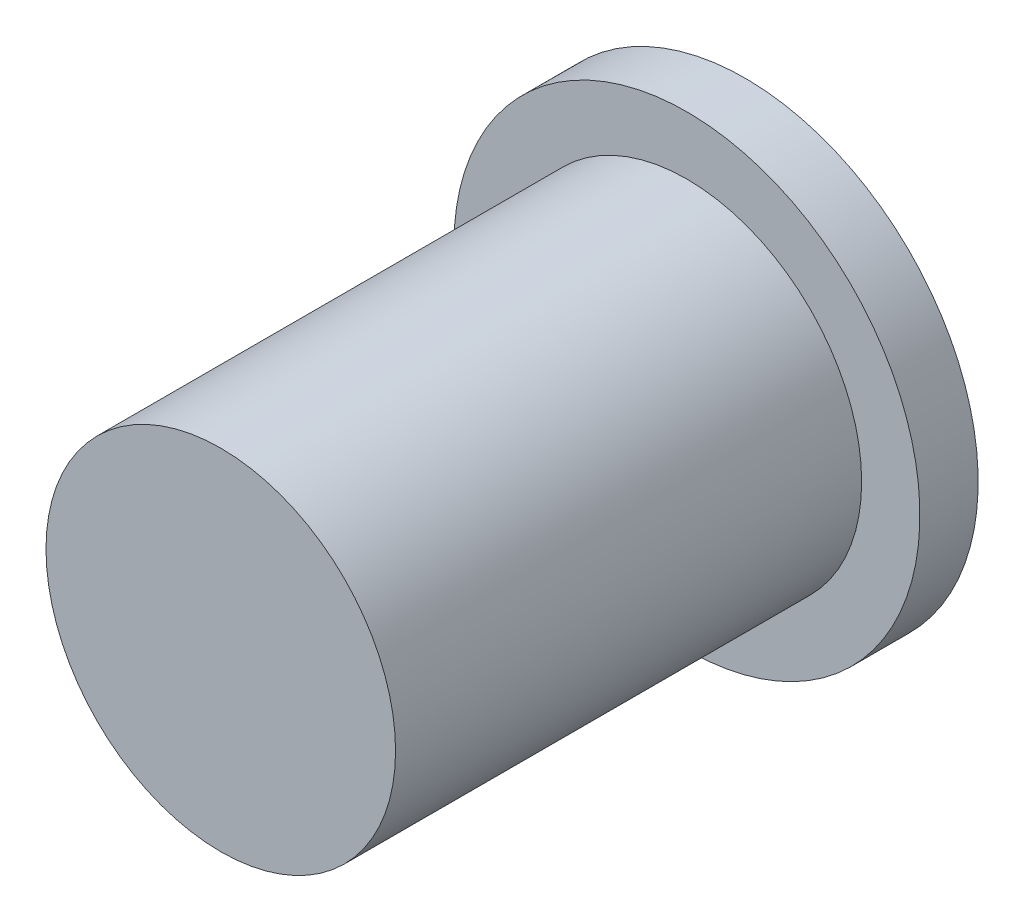
ISO-10303-21;
HEADER;
FILE_DESCRIPTION(('STEP AP214'),'2;1');
FILE_NAME('part.step','',(''),(''),'','','');
FILE_SCHEMA(('AUTOMOTIVE_DESIGN { 1 0 10303 214 1 1 1 1 }'));
ENDSEC;
DATA;
#1=APPLICATION_CONTEXT('core data for automotive mechanical design processes');
#2=APPLICATION_PROTOCOL_DEFINITION('international standard','automotive_design',2000,#1);
#3=PRODUCT_CONTEXT('',#1,'mechanical');
#4=PRODUCT('Part','Part','',(#3));
#5=PRODUCT_RELATED_PRODUCT_CATEGORY('part','',(#4));
#6=PRODUCT_DEFINITION_FORMATION('','',#4);
#7=PRODUCT_DEFINITION_CONTEXT('part definition',#1,'design');
#8=PRODUCT_DEFINITION('design','',#6,#7);
#9=PRODUCT_DEFINITION_SHAPE('','',#8);
#10=(LENGTH_UNIT() NAMED_UNIT(*) SI_UNIT(.MILLI.,.METRE.));
#11=(NAMED_UNIT(*) PLANE_ANGLE_UNIT() SI_UNIT($,.RADIAN.));
#12=(NAMED_UNIT(*) SI_UNIT($,.STERADIAN.) SOLID_ANGLE_UNIT());
#13=UNCERTAINTY_MEASURE_WITH_UNIT(LENGTH_MEASURE(1.E-05),#10,'distance_accuracy_value','');
#14=(GEOMETRIC_REPRESENTATION_CONTEXT(3) GLOBAL_UNCERTAINTY_ASSIGNED_CONTEXT((#13)) GLOBAL_UNIT_ASSIGNED_CONTEXT((#10,
#11,#12)) REPRESENTATION_CONTEXT('',''));
#15=CARTESIAN_POINT('',(0.,0.,0.));
#16=DIRECTION('',(0.,0.,1.));
#17=DIRECTION('',(1.,0.,0.));
#18=AXIS2_PLACEMENT_3D('',#15,#16,#17);
#19=CARTESIAN_POINT('',(0.,0.,40.));
#20=DIRECTION('',(0.,0.,-1.));
#21=DIRECTION('',(-1.,0.,0.));
#22=AXIS2_PLACEMENT_3D('',#19,#20,#21);
#23=CYLINDRICAL_SURFACE('',#22,15.);
#24=CARTESIAN_POINT('',(0.,0.,40.));
#25=DIRECTION('',(0.,0.,1.));
#26=DIRECTION('',(1.,0.,0.));
#27=AXIS2_PLACEMENT_3D('',#24,#25,#26);
#28=CIRCLE('',#27,15.);
#29=CARTESIAN_POINT('',(15.,0.,40.));
#30=VERTEX_POINT('',#29);
#31=EDGE_CURVE('E10',#30,#30,#28,.T.);
#32=ORIENTED_EDGE('',*,*,#31,.F.);
#33=EDGE_LOOP('',(#32));
#34=FACE_BOUND('',#33,.T.);
#35=CARTESIAN_POINT('',(0.,0.,0.));
#36=DIRECTION('',(0.,0.,-1.));
#37=DIRECTION('',(-1.,0.,0.));
#38=AXIS2_PLACEMENT_3D('',#35,#36,#37);
#39=CIRCLE('',#38,15.);
#40=CARTESIAN_POINT('',(-15.,0.,0.));
#41=VERTEX_POINT('',#40);
#42=EDGE_CURVE('E45',#41,#41,#39,.T.);
#43=ORIENTED_EDGE('',*,*,#42,.F.);
#44=EDGE_LOOP('',(#43));
#45=FACE_BOUND('',#44,.T.);
#46=ADVANCED_FACE('F39',(#34,#45),#23,.T.);
#47=CARTESIAN_POINT('',(0.,0.,40.));
#48=DIRECTION('',(0.,0.,1.));
#49=DIRECTION('',(1.,0.,0.));
#50=AXIS2_PLACEMENT_3D('',#47,#48,#49);
#51=PLANE('',#50);
#52=ORIENTED_EDGE('',*,*,#31,.T.);
#53=EDGE_LOOP('',(#52));
#54=FACE_BOUND('',#53,.T.);
#55=ADVANCED_FACE('F72',(#54),#51,.T.);
#56=CARTESIAN_POINT('',(0.,0.,-5.));
#57=DIRECTION('',(0.,0.,1.));
#58=DIRECTION('',(1.,0.,0.));
#59=AXIS2_PLACEMENT_3D('',#56,#57,#58);
#60=CYLINDRICAL_SURFACE('',#59,20.);
#61=CARTESIAN_POINT('',(0.,0.,-5.));
#62=DIRECTION('',(0.,0.,-1.));
#63=DIRECTION('',(-1.,0.,0.));
#64=AXIS2_PLACEMENT_3D('',#61,#62,#63);
#65=CIRCLE('',#64,20.);
#66=CARTESIAN_POINT('',(-20.,0.,-5.));
#67=VERTEX_POINT('',#66);
#68=EDGE_CURVE('E49',#67,#67,#65,.T.);
#69=ORIENTED_EDGE('',*,*,#68,.F.);
#70=EDGE_LOOP('',(#69));
#71=FACE_BOUND('',#70,.T.);
#72=CARTESIAN_POINT('',(0.,0.,0.));
#73=DIRECTION('',(0.,0.,-1.));
#74=DIRECTION('',(-1.,0.,0.));
#75=AXIS2_PLACEMENT_3D('',#72,#73,#74);
#76=CIRCLE('',#75,20.);
#77=CARTESIAN_POINT('',(-20.,0.,0.));
#78=VERTEX_POINT('',#77);
#79=EDGE_CURVE('E53',#78,#78,#76,.T.);
#80=ORIENTED_EDGE('',*,*,#79,.T.);
#81=EDGE_LOOP('',(#80));
#82=FACE_BOUND('',#81,.T.);
#83=ADVANCED_FACE('F59',(#71,#82),#60,.T.);
#84=CARTESIAN_POINT('',(0.,0.,-5.));
#85=DIRECTION('',(0.,0.,-1.));
#86=DIRECTION('',(-1.,0.,0.));
#87=AXIS2_PLACEMENT_3D('',#84,#85,#86);
#88=PLANE('',#87);
#89=ORIENTED_EDGE('',*,*,#68,.T.);
#90=EDGE_LOOP('',(#89));
#91=FACE_BOUND('',#90,.T.);
#92=ADVANCED_FACE('F63',(#91),#88,.T.);
#93=CARTESIAN_POINT('',(0.,0.,0.));
#94=DIRECTION('',(0.,0.,-1.));
#95=DIRECTION('',(-1.,0.,0.));
#96=AXIS2_PLACEMENT_3D('',#93,#94,#95);
#97=PLANE('',#96);
#98=ORIENTED_EDGE('',*,*,#42,.T.);
#99=EDGE_LOOP('',(#98));
#100=FACE_BOUND('',#99,.T.);
#101=ORIENTED_EDGE('',*,*,#79,.F.);
#102=EDGE_LOOP('',(#101));
#103=FACE_BOUND('',#102,.T.);
#104=ADVANCED_FACE('F61',(#100,#103),#97,.F.);
#105=CLOSED_SHELL('',(#46,#55,#83,#92,#104));
#106=MANIFOLD_SOLID_BREP('B2',#105);
#107=ADVANCED_BREP_SHAPE_REPRESENTATION('',(#18,#106),#14);
#108=SHAPE_DEFINITION_REPRESENTATION(#9,#107);
ENDSEC;
END-ISO-10303-21;
